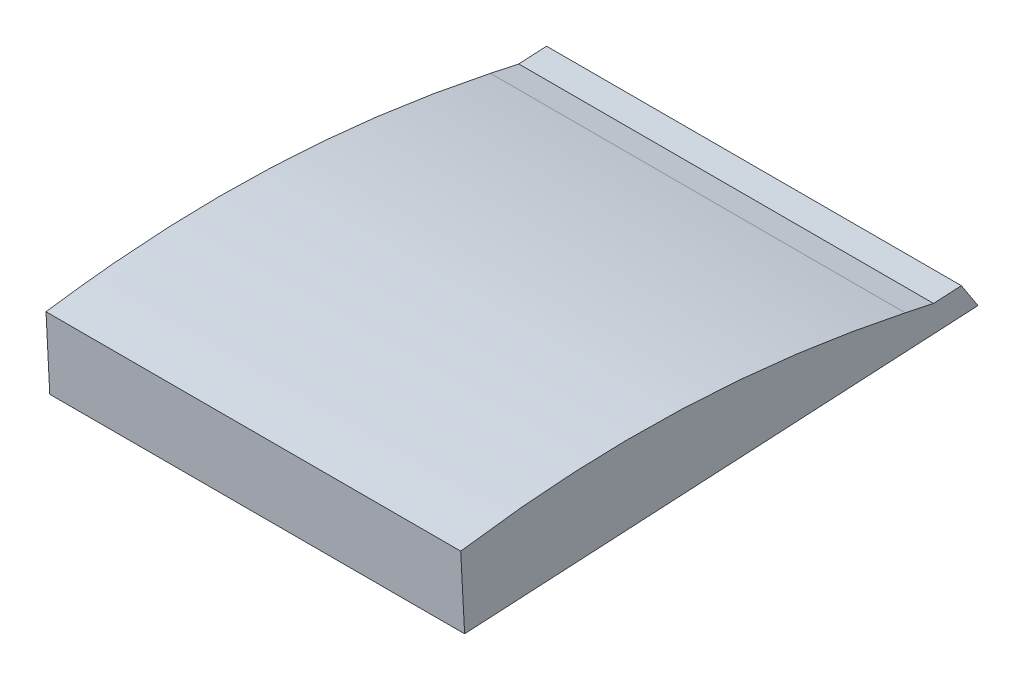
ISO-10303-21;
HEADER;
FILE_DESCRIPTION(('STEP AP214'),'2;1');
FILE_NAME('part.step','',(''),(''),'','','');
FILE_SCHEMA(('AUTOMOTIVE_DESIGN { 1 0 10303 214 1 1 1 1 }'));
ENDSEC;
DATA;
#1=APPLICATION_CONTEXT('core data for automotive mechanical design processes');
#2=APPLICATION_PROTOCOL_DEFINITION('international standard','automotive_design',2000,#1);
#3=PRODUCT_CONTEXT('',#1,'mechanical');
#4=PRODUCT('Part','Part','',(#3));
#5=PRODUCT_RELATED_PRODUCT_CATEGORY('part','',(#4));
#6=PRODUCT_DEFINITION_FORMATION('','',#4);
#7=PRODUCT_DEFINITION_CONTEXT('part definition',#1,'design');
#8=PRODUCT_DEFINITION('design','',#6,#7);
#9=PRODUCT_DEFINITION_SHAPE('','',#8);
#10=(LENGTH_UNIT() NAMED_UNIT(*) SI_UNIT(.MILLI.,.METRE.));
#11=(NAMED_UNIT(*) PLANE_ANGLE_UNIT() SI_UNIT($,.RADIAN.));
#12=(NAMED_UNIT(*) SI_UNIT($,.STERADIAN.) SOLID_ANGLE_UNIT());
#13=UNCERTAINTY_MEASURE_WITH_UNIT(LENGTH_MEASURE(1.E-05),#10,'distance_accuracy_value','');
#14=(GEOMETRIC_REPRESENTATION_CONTEXT(3) GLOBAL_UNCERTAINTY_ASSIGNED_CONTEXT((#13)) GLOBAL_UNIT_ASSIGNED_CONTEXT((#10,
#11,#12)) REPRESENTATION_CONTEXT('',''));
#15=CARTESIAN_POINT('',(0.,0.,0.));
#16=DIRECTION('',(0.,0.,1.));
#17=DIRECTION('',(1.,0.,0.));
#18=AXIS2_PLACEMENT_3D('',#15,#16,#17);
#19=CARTESIAN_POINT('',(-177.805940246243,-33.0381702413849,-314.355519034823));
#20=DIRECTION('',(-2.29475219526301E-07,0.0534934907984705,-0.998568198192863));
#21=DIRECTION('',(0.,0.99856819819289,0.053493490798472));
#22=AXIS2_PLACEMENT_3D('',#19,#20,#21);
#23=PLANE('',#22);
#24=CARTESIAN_POINT('',(-339.4243660882,-30.5401987010888,-314.221665077456));
#25=CARTESIAN_POINT('',(-312.486971740172,-30.5402152320651,-314.221672153351));
#26=CARTESIAN_POINT('',(-285.549577392142,-30.5402267068268,-314.221678958384));
#27=CARTESIAN_POINT('',(-231.674788696076,-30.540239543921,-314.221692026726));
#28=CARTESIAN_POINT('',(-204.737394348038,-30.5402409062534,-314.221698290034));
#29=CARTESIAN_POINT('',(-177.8,-30.5402372123712,-314.22170428248));
#30=B_SPLINE_CURVE_WITH_KNOTS('',3,(#24,#25,#26,#27,#28,#29),.UNSPECIFIED.,.F.,.F.,(4,2,4),(0.,
80.8121830440984,161.624366088212),.UNSPECIFIED.);
#31=CARTESIAN_POINT('',(-338.453246242115,-30.5401994156522,-314.221665338883));
#32=VERTEX_POINT('',#31);
#33=CARTESIAN_POINT('',(-177.8,-30.5402372123712,-314.22170428248));
#34=VERTEX_POINT('',#33);
#35=EDGE_CURVE('E107',#32,#34,#30,.T.);
#36=ORIENTED_EDGE('',*,*,#35,.T.);
#37=DIRECTION('',(0.,-0.99856819819289,-0.053493490798472));
#38=VECTOR('',#37,1.);
#39=CARTESIAN_POINT('',(-177.8,16.697356429359,-311.691177288541));
#40=LINE('',#39,#38);
#41=CARTESIAN_POINT('',(-177.8,-2.0412015642015,-312.695005454378));
#42=VERTEX_POINT('',#41);
#43=EDGE_CURVE('E110',#42,#34,#40,.T.);
#44=ORIENTED_EDGE('',*,*,#43,.F.);
#45=CARTESIAN_POINT('',(-177.8,-2.04120156395444,-312.695005454346));
#46=CARTESIAN_POINT('',(-231.674788696067,-2.041203180511,-312.694993159211));
#47=CARTESIAN_POINT('',(-285.549577392133,-2.04120479706756,-312.694980864076));
#48=CARTESIAN_POINT('',(-339.4243660882,-2.04120641362412,-312.694968568941));
#49=B_SPLINE_CURVE_WITH_KNOTS('',3,(#45,#46,#47,#48),.UNSPECIFIED.,.F.,.F.,(4,4),(0.,
161.624366088204),.UNSPECIFIED.);
#50=CARTESIAN_POINT('',(-338.385473794122,-2.04120638245378,-312.694968806027));
#51=VERTEX_POINT('',#50);
#52=EDGE_CURVE('E101',#42,#51,#49,.T.);
#53=ORIENTED_EDGE('',*,*,#52,.T.);
#54=DIRECTION('',(0.0023746530409731,0.998565382766486,0.0534933394298316));
#55=VECTOR('',#54,1.);
#56=CARTESIAN_POINT('',(-338.458280662959,-32.6572237938514,-314.335074741631));
#57=LINE('',#56,#55);
#58=EDGE_CURVE('E11',#32,#51,#57,.T.);
#59=ORIENTED_EDGE('',*,*,#58,.F.);
#60=EDGE_LOOP('',(#36,#44,#53,#59));
#61=FACE_BOUND('',#60,.T.);
#62=ADVANCED_FACE('F42',(#61),#23,.F.);
#63=CARTESIAN_POINT('',(-338.458326349272,-22.0071834208376,-513.140414741347));
#64=DIRECTION('',(-0.999997180507466,0.00237124073306189,0.000127257626607574));
#65=DIRECTION('',(-0.00237124075226242,-0.999997188604695,0.));
#66=AXIS2_PLACEMENT_3D('',#63,#64,#65);
#67=PLANE('',#66);
#68=CARTESIAN_POINT('',(-338.421966107711,-8.1921973731203,-484.839703055914));
#69=CARTESIAN_POINT('',(-338.421181065183,-7.9276801352114,-483.599649557664));
#70=CARTESIAN_POINT('',(-338.420407774643,-7.66817612943677,-482.358530301791));
#71=CARTESIAN_POINT('',(-338.418883804352,-7.1588090860353,-479.874324665595));
#72=CARTESIAN_POINT('',(-338.418133124422,-6.90894597217243,-478.631238300909));
#73=CARTESIAN_POINT('',(-338.416653468575,-6.41847064717817,-476.143241201893));
#74=CARTESIAN_POINT('',(-338.415924492693,-6.17785845103524,-474.898330464612));
#75=CARTESIAN_POINT('',(-338.414487373297,-5.70550989820997,-472.406823872788));
#76=CARTESIAN_POINT('',(-338.413779229836,-5.4737735643915,-471.160228013912));
#77=CARTESIAN_POINT('',(-338.412385940311,-5.01977728493128,-468.671173843882));
#78=CARTESIAN_POINT('',(-338.41170070426,-4.79747901518335,-467.428722518508));
#79=CARTESIAN_POINT('',(-338.41034945336,-4.36106545726815,-464.942384422169));
#80=CARTESIAN_POINT('',(-338.409683438495,-4.14695016213672,-463.698497652426));
#81=CARTESIAN_POINT('',(-338.408371302922,-3.72718615667847,-461.209292300444));
#82=CARTESIAN_POINT('',(-338.407725182267,-3.5215374684522,-459.963973714477));
#83=CARTESIAN_POINT('',(-338.406453325483,-3.11891182771031,-457.471935427268));
#84=CARTESIAN_POINT('',(-338.405827589353,-2.92193487406001,-456.225215726208));
#85=CARTESIAN_POINT('',(-338.4045993552,-2.53760176819606,-453.735114485534));
#86=CARTESIAN_POINT('',(-338.403996778324,-2.35021208381346,-452.491738126354));
#87=CARTESIAN_POINT('',(-338.402812941867,-1.98449397637572,-450.003655845422));
#88=CARTESIAN_POINT('',(-338.402231682286,-1.80616555321468,-448.758949923684));
#89=CARTESIAN_POINT('',(-338.400520292365,-1.28494182933728,-445.022921022155));
#90=CARTESIAN_POINT('',(-338.399422539028,-0.955804374409624,-442.529662968792));
#91=CARTESIAN_POINT('',(-338.397317971084,-0.335731146042398,-437.545921480532));
#92=CARTESIAN_POINT('',(-338.396310896304,-0.0446849161839743,-435.055451764851));
#93=CARTESIAN_POINT('',(-338.394385558934,0.499732384497002,-430.070387377483));
#94=CARTESIAN_POINT('',(-338.39346729651,0.753103384689815,-427.575792698071));
#95=CARTESIAN_POINT('',(-338.391722886641,1.22108098968549,-422.588135704244));
#96=CARTESIAN_POINT('',(-338.390896553907,1.43576612991089,-420.095080762749));
#97=CARTESIAN_POINT('',(-338.389335389288,1.82638585304561,-415.105935233159));
#98=CARTESIAN_POINT('',(-338.388600557353,2.00232045716166,-412.609844646727));
#99=CARTESIAN_POINT('',(-338.387224423397,2.31475677389295,-407.617858135544));
#100=CARTESIAN_POINT('',(-338.386583022793,2.45130020111536,-405.121964823881));
#101=CARTESIAN_POINT('',(-338.385394005156,2.6847373113862,-400.128325413424));
#102=CARTESIAN_POINT('',(-338.384846388004,2.78163104495287,-397.630579316995));
#103=CARTESIAN_POINT('',(-338.383845990461,2.93531325698474,-392.633022639554));
#104=CARTESIAN_POINT('',(-338.383393241566,2.99208843081899,-390.133211648658));
#105=CARTESIAN_POINT('',(-338.382584023607,3.06500304324894,-385.132980265987));
#106=CARTESIAN_POINT('',(-338.382227555056,3.081142265492,-382.632559871038));
#107=CARTESIAN_POINT('',(-338.381611856428,3.07230094663888,-377.629623665351));
#108=CARTESIAN_POINT('',(-338.381352710973,3.04728472210825,-375.127107918541));
#109=CARTESIAN_POINT('',(-338.380933335043,2.95558014722218,-370.122862691081));
#110=CARTESIAN_POINT('',(-338.380773103012,2.88889245245103,-367.621133198681));
#111=CARTESIAN_POINT('',(-338.380607809139,2.75714131201452,-363.86727505823));
#112=CARTESIAN_POINT('',(-338.38056521548,2.70787500503272,-362.614573609592));
#113=CARTESIAN_POINT('',(-338.380505258393,2.59872698329998,-360.109630198752));
#114=CARTESIAN_POINT('',(-338.380487894961,2.53884527015886,-358.857388236481));
#115=CARTESIAN_POINT('',(-338.380478066317,2.4086085872441,-356.353403583727));
#116=CARTESIAN_POINT('',(-338.380485602038,2.33825322497624,-355.101660913718));
#117=CARTESIAN_POINT('',(-338.380525299071,2.18719084924111,-352.598798445413));
#118=CARTESIAN_POINT('',(-338.380557460401,2.10648382815962,-351.347678647576));
#119=CARTESIAN_POINT('',(-338.380631430017,1.96327734740154,-349.260513894903));
#120=CARTESIAN_POINT('',(-338.380666512497,1.90360381755742,-348.424273848118));
#121=CARTESIAN_POINT('',(-338.380747483531,1.77971767487551,-346.752129963033));
#122=CARTESIAN_POINT('',(-338.380793372081,1.71550506371535,-345.91622612461));
#123=CARTESIAN_POINT('',(-338.380895833481,1.5825932669786,-344.244776161936));
#124=CARTESIAN_POINT('',(-338.38095240632,1.5138940859755,-343.409230037322));
#125=CARTESIAN_POINT('',(-338.381076511464,1.37189838510836,-341.738593853702));
#126=CARTESIAN_POINT('',(-338.381144042914,1.29860222435389,-340.9035037642));
#127=CARTESIAN_POINT('',(-338.381290436261,1.14725472802511,-339.233753828497));
#128=CARTESIAN_POINT('',(-338.381369298165,1.06920338969506,-338.399093982547));
#129=CARTESIAN_POINT('',(-338.381538696809,0.9082023305549,-336.730242306721));
#130=CARTESIAN_POINT('',(-338.381629233608,0.825252584793145,-335.896050479251));
#131=CARTESIAN_POINT('',(-338.381822733186,0.653951589037201,-334.22466250792));
#132=CARTESIAN_POINT('',(-338.381925746809,0.565579014314354,-333.387468547978));
#133=CARTESIAN_POINT('',(-338.382144253551,0.383601705846196,-331.713652322694));
#134=CARTESIAN_POINT('',(-338.382259746627,0.289996990027161,-330.877030055404));
#135=CARTESIAN_POINT('',(-338.382503509565,0.0974330337181293,-329.204413237958));
#136=CARTESIAN_POINT('',(-338.382631779239,-0.00152612815640652,-328.368418678768));
#137=CARTESIAN_POINT('',(-338.382834159871,-0.15414692675181,-327.114893861878));
#138=CARTESIAN_POINT('',(-338.382903286616,-0.205720321518228,-326.697108416598));
#139=CARTESIAN_POINT('',(-338.38304455333,-0.310129384296508,-325.861695169495));
#140=CARTESIAN_POINT('',(-338.3831166933,-0.362965052859836,-325.444067367741));
#141=CARTESIAN_POINT('',(-338.383336725389,-0.522985359156332,-324.191370740989));
#142=CARTESIAN_POINT('',(-338.383488228579,-0.631682467389962,-323.356495452376));
#143=CARTESIAN_POINT('',(-338.383796451968,-0.851261666058094,-321.687026785455));
#144=CARTESIAN_POINT('',(-338.383953172214,-0.962143776247043,-320.852433409766));
#145=CARTESIAN_POINT('',(-338.384189159753,-1.12892866158154,-319.599068533883));
#146=CARTESIAN_POINT('',(-338.384268116331,-1.18470133318535,-319.180279679156));
#147=CARTESIAN_POINT('',(-338.384425614636,-1.29607296418954,-318.342678898292));
#148=CARTESIAN_POINT('',(-338.384504156363,-1.35167192361084,-317.923866972156));
#149=CARTESIAN_POINT('',(-338.384660702772,-1.46264478904278,-317.086216499264));
#150=CARTESIAN_POINT('',(-338.384738707458,-1.51801869673389,-316.66737795273));
#151=CARTESIAN_POINT('',(-338.38489435925,-1.62861677631125,-315.829681061893));
#152=CARTESIAN_POINT('',(-338.384972006356,-1.68384094818454,-315.410822717589));
#153=CARTESIAN_POINT('',(-338.385204579441,-1.84935910309539,-314.154230354546));
#154=CARTESIAN_POINT('',(-338.385359137734,-1.95949911403767,-313.316476066499));
#155=CARTESIAN_POINT('',(-338.385668212375,-2.179752586274,-311.641132580794));
#156=CARTESIAN_POINT('',(-338.385822728724,-2.28986604851011,-310.803543383259));
#157=CARTESIAN_POINT('',(-338.386132836209,-2.51054320965579,-309.12842128005));
#158=CARTESIAN_POINT('',(-338.386288427348,-2.62110691014257,-308.290888374582));
#159=CARTESIAN_POINT('',(-338.386600670542,-2.84267889968388,-306.615875103984));
#160=CARTESIAN_POINT('',(-338.386757322605,-2.95368719200352,-305.778394739286));
#161=CARTESIAN_POINT('',(-338.386914497317,-3.06491433448685,-304.940943462951));
#162=B_SPLINE_CURVE_WITH_KNOTS('',3,(#68,#69,#70,#71,#72,#73,#74,#75,#76,#77,#78,#79,#80,#81,
#82,#83,#84,#85,#86,#87,#88,#89,#90,#91,#92,#93,#94,#95,#96,#97,#98,#99,#100,#101,#102,#103,
#104,#105,#106,#107,#108,#109,#110,#111,#112,#113,#114,#115,#116,#117,#118,#119,#120,#121,#122,
#123,#124,#125,#126,#127,#128,#129,#130,#131,#132,#133,#134,#135,#136,#137,#138,#139,#140,#141,
#142,#143,#144,#145,#146,#147,#148,#149,#150,#151,#152,#153,#154,#155,#156,#157,#158,#159,#160,
#161),.UNSPECIFIED.,.F.,.F.,(4,2,2,2,2,2,2,2,2,2,2,2,2,2,2,2,2,2,2,2,2,2,2,2,2,2,2,2,2,2,2,2,2,
2,2,2,2,2,2,2,2,2,2,2,2,2,4),(0.,3.80384090473611,7.60765172416373,11.4114687063184,
15.2152954862947,19.001812757504,22.7883268061113,26.5748507381017,30.3613741746301,
34.1335938534063,37.9058134880981,45.4501801000073,52.9721606080707,60.4941552174103,
68.0007031780823,75.5072470306889,83.0058121489985,90.5043677132498,98.0054088789903,
105.506489981449,113.014078252456,120.521548415486,124.28252084476,128.043492703687,
131.804605538456,135.56572113975,138.080809289137,140.595896508962,143.110981165019,
145.625869590351,148.140759473141,150.655662167455,153.18118180762,155.706692795422,
158.232166713029,159.495034798765,160.757903436238,163.283661136925,165.809441683295,
167.076900694069,168.344359552236,169.611808928887,170.879258415342,173.41414849398,
175.948537134471,178.482934660627,181.017350833808),.UNSPECIFIED.);
#163=CARTESIAN_POINT('',(-338.421966107711,-8.1921973731203,-484.839703055914));
#164=VERTEX_POINT('',#163);
#165=EDGE_CURVE('E105',#164,#51,#162,.T.);
#166=ORIENTED_EDGE('',*,*,#165,.F.);
#167=DIRECTION('',(0.000619140515082298,0.208617015467726,0.977997217543262));
#168=VECTOR('',#167,1.);
#169=CARTESIAN_POINT('',(-338.421904535693,-8.17145091853281,-484.742443612263));
#170=LINE('',#169,#168);
#171=CARTESIAN_POINT('',(-338.428910877982,-10.5322169560735,-495.811485536326));
#172=VERTEX_POINT('',#171);
#173=EDGE_CURVE('E163',#172,#164,#170,.T.);
#174=ORIENTED_EDGE('',*,*,#173,.F.);
#175=CARTESIAN_POINT('',(-338.428910514005,-9.95417148300831,-506.57767153548));
#176=CARTESIAN_POINT('',(-338.428910539208,-10.0069259570138,-505.594873412896));
#177=CARTESIAN_POINT('',(-338.428910564299,-10.0596804275362,-504.612075290126));
#178=CARTESIAN_POINT('',(-338.428910614351,-10.1651893616146,-502.64647904421));
#179=CARTESIAN_POINT('',(-338.428910639312,-10.2179438251707,-501.663680921065));
#180=CARTESIAN_POINT('',(-338.428910706009,-10.3590122650935,-499.035622595269));
#181=CARTESIAN_POINT('',(-338.428910747711,-10.4473262351817,-497.390362392281));
#182=CARTESIAN_POINT('',(-338.428910789578,-10.535640195508,-495.745102188769));
#183=B_SPLINE_CURVE_WITH_KNOTS('',3,(#175,#176,#177,#178,#179,#180,#181,#182),.UNSPECIFIED.,.F.,
.F.,(4,2,2,4),(0.,2.95263893128455,5.90527786256939,10.8481641080384),.UNSPECIFIED.);
#184=CARTESIAN_POINT('',(-338.428909818147,-9.9539337396788,-506.578014973101));
#185=VERTEX_POINT('',#184);
#186=EDGE_CURVE('E255',#185,#172,#183,.T.);
#187=ORIENTED_EDGE('',*,*,#186,.F.);
#188=CARTESIAN_POINT('',(-338.453200630106,-19.8517672805841,-513.024948684549));
#189=CARTESIAN_POINT('',(-338.445049954709,-16.530565679203,-510.861746521049));
#190=CARTESIAN_POINT('',(-338.436899279311,-13.2093640778218,-508.698544357549));
#191=CARTESIAN_POINT('',(-338.428748603914,-9.8881624764407,-506.535342194049));
#192=B_SPLINE_CURVE_WITH_KNOTS('',3,(#188,#189,#190,#191),.UNSPECIFIED.,.F.,.F.,(4,4),(0.,
11.8907111223964),.UNSPECIFIED.);
#193=CARTESIAN_POINT('',(-338.453200630106,-19.8517672805846,-513.024948684549));
#194=VERTEX_POINT('',#193);
#195=EDGE_CURVE('E175',#194,#185,#192,.T.);
#196=ORIENTED_EDGE('',*,*,#195,.F.);
#197=CARTESIAN_POINT('',(-338.453248371395,-31.0391668536749,-304.940943462951));
#198=CARTESIAN_POINT('',(-338.453232457708,-27.3100336626448,-374.302278536817));
#199=CARTESIAN_POINT('',(-338.453216544022,-23.5809004716147,-443.663613610683));
#200=CARTESIAN_POINT('',(-338.453200630335,-19.8517672805846,-513.024948684549));
#201=B_SPLINE_CURVE_WITH_KNOTS('',3,(#197,#198,#199,#200),.UNSPECIFIED.,.F.,.F.,(4,4),(0.,
208.384527108594),.UNSPECIFIED.);
#202=EDGE_CURVE('E113',#32,#194,#201,.T.);
#203=ORIENTED_EDGE('',*,*,#202,.F.);
#204=ORIENTED_EDGE('',*,*,#58,.T.);
#205=EDGE_LOOP('',(#166,#174,#187,#196,#203,#204));
#206=FACE_BOUND('',#205,.T.);
#207=ADVANCED_FACE('F142',(#206),#67,.T.);
#208=CARTESIAN_POINT('',(-177.8,-6.51913907058263,69.5663617744474));
#209=CARTESIAN_POINT('',(-177.8,-6.88721273253516,69.4883910827677));
#210=CARTESIAN_POINT('',(-177.8,-7.61052758633523,69.3363760132391));
#211=CARTESIAN_POINT('',(-177.8,-8.76184326811464,69.0354225894495));
#212=CARTESIAN_POINT('',(-177.8,-9.88259406782119,68.626070203946));
#213=CARTESIAN_POINT('',(-177.8,-12.021228930256,67.6619851025588));
#214=CARTESIAN_POINT('',(-177.8,-14.9546020256939,65.6923130131807));
#215=CARTESIAN_POINT('',(-177.8,-18.1374494761777,62.3412188200519));
#216=CARTESIAN_POINT('',(-177.8,-21.5964876349103,57.3382189268778));
#217=CARTESIAN_POINT('',(-177.8,-24.7903629698325,50.5220499235312));
#218=CARTESIAN_POINT('',(-177.8,-27.5359775514862,42.0059138994073));
#219=CARTESIAN_POINT('',(-177.8,-29.5513425657538,33.3240400078997));
#220=CARTESIAN_POINT('',(-177.8,-31.532992144648,21.6352015564033));
#221=CARTESIAN_POINT('',(-177.8,-33.0186008410447,6.91344102508237));
#222=CARTESIAN_POINT('',(-177.8,-33.7765423596692,-10.7972873340441));
#223=CARTESIAN_POINT('',(-177.8,-33.7950491418743,-28.5097311954228));
#224=CARTESIAN_POINT('',(-177.8,-33.2586088383385,-46.2043865238911));
#225=CARTESIAN_POINT('',(-177.8,-31.9669194489648,-69.7641945581866));
#226=CARTESIAN_POINT('',(-177.8,-29.5034076215053,-99.1460197389462));
#227=CARTESIAN_POINT('',(-177.8,-25.6933715620582,-134.308212307564));
#228=CARTESIAN_POINT('',(-177.8,-21.3490549530988,-169.399514794737));
#229=CARTESIAN_POINT('',(-177.8,-16.7038848255612,-204.446464420127));
#230=CARTESIAN_POINT('',(-177.8,-11.9288122826792,-239.471434511741));
#231=CARTESIAN_POINT('',(-177.8,-7.93942067939684,-268.654643904962));
#232=CARTESIAN_POINT('',(-177.8,-4.79172290140647,-292.007732636027));
#233=CARTESIAN_POINT('',(-177.8,-2.83780100098235,-306.600292672818));
#234=CARTESIAN_POINT('',(-177.8,-1.30907436693598,-318.288997719976));
#235=CARTESIAN_POINT('',(-177.8,0.263068831943658,-329.949567815073));
#236=CARTESIAN_POINT('',(-177.8,1.719295513011,-344.570295270056));
#237=CARTESIAN_POINT('',(-177.8,2.80506666571039,-362.175990442094));
#238=CARTESIAN_POINT('',(-177.8,3.31793184017618,-385.687405296962));
#239=CARTESIAN_POINT('',(-177.8,2.25388387982141,-415.082460117617));
#240=CARTESIAN_POINT('',(-177.8,-0.960221939673565,-444.321872591633));
#241=CARTESIAN_POINT('',(-177.8,-4.72777257870521,-467.542126740326));
#242=CARTESIAN_POINT('',(-177.8,-6.96557190432381,-479.089279042028));
#243=CARTESIAN_POINT('',(-177.8,-8.1921973731203,-484.839703055914));
#244=B_SPLINE_CURVE_WITH_KNOTS('',3,(#208,#209,#210,#211,#212,#213,#214,#215,#216,#217,#218,
#219,#220,#221,#222,#223,#224,#225,#226,#227,#228,#229,#230,#231,#232,#233,#234,#235,#236,#237,
#238,#239,#240,#241,#242,#243),.UNSPECIFIED.,.F.,.F.,(4,1,1,1,1,1,1,1,1,1,1,1,1,1,1,1,1,1,1,1,1,
1,1,1,1,1,1,1,1,1,1,1,1,4),(-6.87555594952044E-05,0.00188450372870693,0.00383776301690907,
0.00579102230511121,0.00774428159331335,0.0155573187461219,0.0233703558989304,0.031183393051739,
0.0468094673573561,0.0624355416629732,0.0780616159685904,0.0936876902742075,0.124939838885442,
0.156191987496676,0.18744413610791,0.218696284719144,0.249948433330378,0.312452730552847,
0.374957027775315,0.437461324997784,0.499965622220252,0.562469919442721,0.624974216665189,
0.656226365276424,0.687478513887658,0.703104588193275,0.718730662498892,0.749982811110126,
0.78123495972136,0.812487108332595,0.874991405555063,0.937495702777532,0.968747851388766,1.),.UNSPECIFIED.);
#245=DIRECTION('',(-1.,0.,0.));
#246=VECTOR('',#245,1.);
#247=SURFACE_OF_LINEAR_EXTRUSION('',#244,#246);
#248=ORIENTED_EDGE('',*,*,#52,.F.);
#249=CARTESIAN_POINT('',(-177.8,-8.1921973731203,-484.839703055914));
#250=VERTEX_POINT('',#249);
#251=EDGE_CURVE('E71',#42,#250,#244,.T.);
#252=ORIENTED_EDGE('',*,*,#251,.T.);
#253=DIRECTION('',(-1.,0.,0.));
#254=VECTOR('',#253,1.);
#255=CARTESIAN_POINT('',(-177.8,-8.1921973731203,-484.839703055914));
#256=LINE('',#255,#254);
#257=EDGE_CURVE('E126',#250,#164,#256,.T.);
#258=ORIENTED_EDGE('',*,*,#257,.T.);
#259=ORIENTED_EDGE('',*,*,#165,.T.);
#260=EDGE_LOOP('',(#248,#252,#258,#259));
#261=FACE_BOUND('',#260,.T.);
#262=ADVANCED_FACE('F103',(#261),#247,.T.);
#263=CARTESIAN_POINT('',(-177.8,0.,0.));
#264=DIRECTION('',(-1.,0.,0.));
#265=DIRECTION('',(0.,0.,1.));
#266=AXIS2_PLACEMENT_3D('',#263,#264,#265);
#267=PLANE('',#266);
#268=ORIENTED_EDGE('',*,*,#251,.F.);
#269=ORIENTED_EDGE('',*,*,#43,.T.);
#270=DIRECTION('',(0.,-0.0536864833252265,0.998557840842567));
#271=VECTOR('',#270,1.);
#272=CARTESIAN_POINT('',(-177.8,-19.8517756392125,-513.024949519574));
#273=LINE('',#272,#271);
#274=CARTESIAN_POINT('',(-177.8,-19.8517756392125,-513.024949519574));
#275=VERTEX_POINT('',#274);
#276=EDGE_CURVE('E124',#275,#34,#273,.T.);
#277=ORIENTED_EDGE('',*,*,#276,.F.);
#278=DIRECTION('',(0.,-0.837933215655186,-0.545772778820783));
#279=VECTOR('',#278,1.);
#280=CARTESIAN_POINT('',(-177.8,92.2081632145719,-440.03671718784));
#281=LINE('',#280,#279);
#282=CARTESIAN_POINT('',(-177.8,-9.95392768556176,-506.578163688574));
#283=VERTEX_POINT('',#282);
#284=EDGE_CURVE('E62',#283,#275,#281,.T.);
#285=ORIENTED_EDGE('',*,*,#284,.F.);
#286=DIRECTION('',(0.,0.0536864833252206,-0.998557840842568));
#287=VECTOR('',#286,1.);
#288=CARTESIAN_POINT('',(-177.8,-10.2433380586428,-501.195188694467));
#289=LINE('',#288,#287);
#290=CARTESIAN_POINT('',(-177.8,-10.5327484317238,-495.81221370036));
#291=VERTEX_POINT('',#290);
#292=EDGE_CURVE('E54',#291,#283,#289,.T.);
#293=ORIENTED_EDGE('',*,*,#292,.F.);
#294=DIRECTION('',(0.,-0.208617055452837,-0.977997404993586));
#295=VECTOR('',#294,1.);
#296=CARTESIAN_POINT('',(-177.8,-8.1921973731203,-484.839703055914));
#297=LINE('',#296,#295);
#298=EDGE_CURVE('E117',#250,#291,#297,.T.);
#299=ORIENTED_EDGE('',*,*,#298,.F.);
#300=EDGE_LOOP('',(#268,#269,#277,#285,#293,#299));
#301=FACE_BOUND('',#300,.T.);
#302=ADVANCED_FACE('F115',(#301),#267,.F.);
#303=CARTESIAN_POINT('',(-177.8,-10.5327484317238,-495.81221370036));
#304=CARTESIAN_POINT('',(-274.207207620428,-10.532748431724,-495.81221370036));
#305=CARTESIAN_POINT('',(-376.016408166547,-10.532743263631,-495.812208410507));
#306=CARTESIAN_POINT('',(-478.598502144422,-10.52834825828,-495.807709851592));
#307=CARTESIAN_POINT('',(-484.78976742605,-10.5346710511193,-495.814181619831));
#308=CARTESIAN_POINT('',(-485.586919347094,-10.5438544894442,-495.823581435074));
#309=CARTESIAN_POINT('',(-485.898481465598,-10.5318587580024,-495.811303064461));
#310=CARTESIAN_POINT('',(-486.364982708455,-10.4951657543597,-495.773745513276));
#311=CARTESIAN_POINT('',(-490.154991884245,-10.2587392399741,-495.531748401184));
#312=CARTESIAN_POINT('',(-493.937468198988,-10.0216632597841,-495.289086520806));
#313=CARTESIAN_POINT('',(-497.394940800443,-9.80517690591262,-495.06749939222));
#314=CARTESIAN_POINT('',(-177.8,-10.3398081830031,-499.400863696431));
#315=CARTESIAN_POINT('',(-274.209418385163,-10.3398081830033,-499.400863696431));
#316=CARTESIAN_POINT('',(-376.020964999451,-10.3398096449536,-499.400850263422));
#317=CARTESIAN_POINT('',(-478.598950286788,-10.3373942044883,-499.396812477319));
#318=CARTESIAN_POINT('',(-484.789762654161,-10.3409407130188,-499.402476865087));
#319=CARTESIAN_POINT('',(-485.586696813438,-10.3474601962453,-499.407941600412));
#320=CARTESIAN_POINT('',(-485.898471801464,-10.3387856060166,-499.40112355767));
#321=CARTESIAN_POINT('',(-486.365645745773,-10.312296407861,-499.380177483482));
#322=CARTESIAN_POINT('',(-490.159006538096,-10.1388025714563,-499.250895227081));
#323=CARTESIAN_POINT('',(-493.938944912067,-9.96427417884317,-499.122384197364));
#324=CARTESIAN_POINT('',(-497.394170964434,-9.8052415520001,-499.0043512248));
#325=CARTESIAN_POINT('',(-177.8,-10.1468679342825,-502.989513692503));
#326=CARTESIAN_POINT('',(-274.211629149898,-10.1468679342826,-502.989513692501));
#327=CARTESIAN_POINT('',(-376.025521832354,-10.1468760262763,-502.989492116337));
#328=CARTESIAN_POINT('',(-478.599398429154,-10.1464401506966,-502.985915103046));
#329=CARTESIAN_POINT('',(-484.789757882272,-10.1472103749182,-502.990772110343));
#330=CARTESIAN_POINT('',(-485.586474279782,-10.1510659030465,-502.99230176575));
#331=CARTESIAN_POINT('',(-485.898462137329,-10.1457124540309,-502.990944050878));
#332=CARTESIAN_POINT('',(-486.366308783091,-10.1294270613623,-502.986609453688));
#333=CARTESIAN_POINT('',(-490.163021191948,-10.0188659029384,-502.970042052979));
#334=CARTESIAN_POINT('',(-493.940421625146,-9.9068850979022,-502.955681873922));
#335=CARTESIAN_POINT('',(-497.393401128424,-9.80530619808759,-502.94120305738));
#336=CARTESIAN_POINT('',(-177.8,-9.9539276855618,-506.578163688574));
#337=CARTESIAN_POINT('',(-274.213839914632,-9.95392768556193,-506.578163688573));
#338=CARTESIAN_POINT('',(-376.030078665256,-9.95394240759896,-506.578133969256));
#339=CARTESIAN_POINT('',(-478.59984657152,-9.95548609690482,-506.575017728773));
#340=CARTESIAN_POINT('',(-484.789753110383,-9.95348003681767,-506.579067355599));
#341=CARTESIAN_POINT('',(-485.586251746126,-9.95467160984757,-506.576661931089));
#342=CARTESIAN_POINT('',(-485.898452473195,-9.95263930204514,-506.580764544087));
#343=CARTESIAN_POINT('',(-486.366971820409,-9.94655771486366,-506.593041423894));
#344=CARTESIAN_POINT('',(-490.1670358458,-9.89892923442059,-506.689188878877));
#345=CARTESIAN_POINT('',(-493.941898338224,-9.84949601696124,-506.78897955048));
#346=CARTESIAN_POINT('',(-497.392631292415,-9.80537084417507,-506.878054889959));
#347=B_SPLINE_SURFACE_WITH_KNOTS('',3,3,((#303,#304,#305,#306,#307,#308,#309,#310,#311,#312,
#313),(#314,#315,#316,#317,#318,#319,#320,#321,#322,#323,#324),(#325,#326,#327,#328,#329,#330,
#331,#332,#333,#334,#335),(#336,#337,#338,#339,#340,#341,#342,#343,#344,#345,#346)),
.UNSPECIFIED.,.F.,.F.,.F.,(4,4),(4,1,1,1,1,1,1,1,4),(0.,1.),(0.,0.90625,0.95703125,0.962890625,
0.96435546875,0.96450845898134,0.9658203125,0.96875,1.),.UNSPECIFIED.);
#348=CARTESIAN_POINT('',(-177.8,-9.9539276855618,-506.578163688574));
#349=CARTESIAN_POINT('',(-274.213839914632,-9.95392768556193,-506.578163688573));
#350=CARTESIAN_POINT('',(-376.030078665256,-9.95394240759896,-506.578133969256));
#351=CARTESIAN_POINT('',(-478.59984657152,-9.95548609690482,-506.575017728773));
#352=CARTESIAN_POINT('',(-484.789753110383,-9.95348003681767,-506.579067355599));
#353=CARTESIAN_POINT('',(-485.586251746126,-9.95467160984757,-506.576661931089));
#354=CARTESIAN_POINT('',(-485.898452473195,-9.95263930204514,-506.580764544087));
#355=CARTESIAN_POINT('',(-486.366971820409,-9.94655771486366,-506.593041423894));
#356=CARTESIAN_POINT('',(-490.1670358458,-9.89892923442059,-506.689188878877));
#357=CARTESIAN_POINT('',(-493.941898338224,-9.84949601696124,-506.78897955048));
#358=CARTESIAN_POINT('',(-497.392631292415,-9.80537084417507,-506.878054889959));
#359=B_SPLINE_CURVE_WITH_KNOTS('',3,(#348,#349,#350,#351,#352,#353,#354,#355,#356,#357,#358),
.UNSPECIFIED.,.F.,.F.,(4,1,1,1,1,1,1,1,4),(0.,0.90625,0.95703125,0.962890625,0.96435546875,
0.96450845898134,0.9658203125,0.96875,1.),.UNSPECIFIED.);
#360=EDGE_CURVE('E211',#283,#185,#359,.T.);
#361=CARTESIAN_POINT('',(-177.8,-10.5327484317237,-495.81221370036));
#362=CARTESIAN_POINT('',(-195.905547489319,-10.5327480908977,-495.812213148644));
#363=CARTESIAN_POINT('',(-214.011094979851,-10.5327482614981,-495.812213424805));
#364=CARTESIAN_POINT('',(-250.222189957317,-10.5326761844897,-495.812096749368));
#365=CARTESIAN_POINT('',(-268.32773744425,-10.5326039368808,-495.811979797769));
#366=CARTESIAN_POINT('',(-294.742475137036,-10.5323921333525,-495.811636938513));
#367=CARTESIAN_POINT('',(-303.051665344397,-10.5323101468247,-495.811504221932));
#368=CARTESIAN_POINT('',(-319.670045756176,-10.5321084638325,-495.811177745404));
#369=CARTESIAN_POINT('',(-327.979235960594,-10.5319887673683,-495.810983985456));
#370=CARTESIAN_POINT('',(-344.597616359219,-10.5317050758423,-495.810524756726));
#371=CARTESIAN_POINT('',(-352.906806553425,-10.5315410807807,-495.810259287943));
#372=CARTESIAN_POINT('',(-369.525186944559,-10.5311627710675,-495.809646894997));
#373=CARTESIAN_POINT('',(-377.834377141487,-10.5309484564158,-495.809299970833));
#374=CARTESIAN_POINT('',(-390.298162467894,-10.5305852931125,-495.808712096302));
#375=CARTESIAN_POINT('',(-394.452757599598,-10.5304572901231,-495.808504890077));
#376=CARTESIAN_POINT('',(-402.76194785593,-10.5301868057522,-495.808067040571));
#377=CARTESIAN_POINT('',(-406.916542980558,-10.5300443243706,-495.807836397291));
#378=CARTESIAN_POINT('',(-415.225733202429,-10.5297443309649,-495.807350779716));
#379=CARTESIAN_POINT('',(-419.380328299671,-10.5295868189407,-495.807095805421));
#380=CARTESIAN_POINT('',(-427.689518513364,-10.5292562529775,-495.806560698187));
#381=CARTESIAN_POINT('',(-431.844113629814,-10.5290831990383,-495.806280565249));
#382=CARTESIAN_POINT('',(-438.076006370027,-10.5288115951607,-495.80584090353));
#383=CARTESIAN_POINT('',(-440.153303994745,-10.528719056705,-495.805691105902));
#384=CARTESIAN_POINT('',(-444.307899232754,-10.5285299143757,-495.805384929708));
#385=CARTESIAN_POINT('',(-446.385196846045,-10.5284333105019,-495.805228551141));
#386=CARTESIAN_POINT('',(-450.539792014286,-10.5282359793606,-495.804909119219));
#387=CARTESIAN_POINT('',(-452.617089569236,-10.5281352520932,-495.804746065863));
#388=CARTESIAN_POINT('',(-456.771684718942,-10.5279296127677,-495.804413184978));
#389=CARTESIAN_POINT('',(-458.848982313699,-10.5278247007096,-495.804243357447));
#390=CARTESIAN_POINT('',(-461.964928795581,-10.5276641623777,-495.803983484283));
#391=CARTESIAN_POINT('',(-463.003577683034,-10.5276101212238,-495.80389600458));
#392=CARTESIAN_POINT('',(-465.080875482529,-10.5275009534944,-495.803719288136));
#393=CARTESIAN_POINT('',(-466.119524394573,-10.5274458269189,-495.803630051395));
#394=CARTESIAN_POINT('',(-468.196822178401,-10.5273345706894,-495.803449954168));
#395=CARTESIAN_POINT('',(-469.235471050185,-10.5272784410353,-495.803359093682));
#396=CARTESIAN_POINT('',(-471.312768738857,-10.5272651192038,-495.803337528823));
#397=CARTESIAN_POINT('',(-472.351417555745,-10.5273079270194,-495.803406824438));
#398=CARTESIAN_POINT('',(-473.909390713477,-10.5275208406789,-495.803751480731));
#399=CARTESIAN_POINT('',(-474.428715088771,-10.5276165955549,-495.803906484974));
#400=CARTESIAN_POINT('',(-475.467363801297,-10.5278700443396,-495.804316757939));
#401=CARTESIAN_POINT('',(-475.98668813853,-10.52802773825,-495.804572026665));
#402=CARTESIAN_POINT('',(-477.025336767934,-10.5284174077029,-495.805202808313));
#403=CARTESIAN_POINT('',(-477.544661060106,-10.5286493832532,-495.805578321248));
#404=CARTESIAN_POINT('',(-478.583309463486,-10.5291999338322,-495.806469530961));
#405=CARTESIAN_POINT('',(-479.102633574695,-10.5295185088577,-495.806985227734));
#406=CARTESIAN_POINT('',(-479.881619750705,-10.5300705089879,-495.807878783924));
#407=CARTESIAN_POINT('',(-480.141281911642,-10.5302668653872,-495.808196637973));
#408=CARTESIAN_POINT('',(-480.660606152935,-10.5306858548653,-495.808874881729));
#409=CARTESIAN_POINT('',(-480.92026823329,-10.5309084879437,-495.809235271436));
#410=CARTESIAN_POINT('',(-481.439592206418,-10.5313814252238,-495.810000843781));
#411=CARTESIAN_POINT('',(-481.69925409919,-10.5316317294152,-495.810406026402));
#412=CARTESIAN_POINT('',(-482.088746933262,-10.5320294641792,-495.81104986386));
#413=CARTESIAN_POINT('',(-482.218577915986,-10.5321657555574,-495.811270487004));
#414=CARTESIAN_POINT('',(-482.478239785705,-10.5324453093713,-495.811723017769));
#415=CARTESIAN_POINT('',(-482.608070672701,-10.5325885718032,-495.811954925382));
#416=CARTESIAN_POINT('',(-482.86773330564,-10.5328848884765,-495.812434591207));
#417=CARTESIAN_POINT('',(-482.997565051584,-10.5330379427855,-495.812682349528));
#418=CARTESIAN_POINT('',(-483.257228777476,-10.5333441619193,-495.813178045067));
#419=CARTESIAN_POINT('',(-483.387060757423,-10.5334973267443,-495.813425982287));
#420=CARTESIAN_POINT('',(-483.646723954543,-10.5338460484696,-495.813990479357));
#421=CARTESIAN_POINT('',(-483.776555171716,-10.5340416051759,-495.814307038894));
#422=CARTESIAN_POINT('',(-484.036216538545,-10.5346248570498,-495.815251184182));
#423=CARTESIAN_POINT('',(-484.1660466882,-10.535012552477,-495.815878770355));
#424=CARTESIAN_POINT('',(-484.382443857066,-10.5359287390021,-495.817361857216));
#425=CARTESIAN_POINT('',(-484.469012218105,-10.5363672750979,-495.818071742272));
#426=CARTESIAN_POINT('',(-484.642142602601,-10.5374295859347,-495.819791369446));
#427=CARTESIAN_POINT('',(-484.728704626166,-10.538053355584,-495.820801103322));
#428=CARTESIAN_POINT('',(-484.858539510956,-10.5391581284588,-495.82258946638));
#429=CARTESIAN_POINT('',(-484.901814998987,-10.5395545563836,-495.823231188378));
#430=CARTESIAN_POINT('',(-484.988360873459,-10.540409393487,-495.824614965198));
#431=CARTESIAN_POINT('',(-485.031631260048,-10.5408677985169,-495.825357013306));
#432=CARTESIAN_POINT('',(-485.118197535197,-10.5418500899584,-495.826947108217));
#433=CARTESIAN_POINT('',(-485.161493422022,-10.5423740187984,-495.827795223702));
#434=CARTESIAN_POINT('',(-485.226439449906,-10.5432183943723,-495.829162065809));
#435=CARTESIAN_POINT('',(-485.248090957425,-10.5435096364398,-495.82963351706));
#436=CARTESIAN_POINT('',(-485.291393516648,-10.5441020831769,-495.830592546633));
#437=CARTESIAN_POINT('',(-485.31304456835,-10.5444032878979,-495.831080125038));
#438=CARTESIAN_POINT('',(-485.377996960315,-10.5452282921528,-495.832415609612));
#439=CARTESIAN_POINT('',(-485.421302563909,-10.5456735699569,-495.833136407881));
#440=CARTESIAN_POINT('',(-485.507903368224,-10.5459043073641,-495.833509916558));
#441=CARTESIAN_POINT('',(-485.551198557698,-10.5456901915008,-495.833163314185));
#442=CARTESIAN_POINT('',(-485.616135752117,-10.5445511333874,-495.831319451526));
#443=CARTESIAN_POINT('',(-485.637802983713,-10.5440341728365,-495.830482616034));
#444=CARTESIAN_POINT('',(-485.681101649318,-10.5426759651842,-495.828284002685));
#445=CARTESIAN_POINT('',(-485.70273308385,-10.5418347228716,-495.826922232579));
#446=CARTESIAN_POINT('',(-485.745982945439,-10.5397851114668,-495.823604401916));
#447=CARTESIAN_POINT('',(-485.767601224016,-10.5385758891881,-495.821646960254));
#448=CARTESIAN_POINT('',(-485.810774364935,-10.5358639883511,-495.817257041399));
#449=CARTESIAN_POINT('',(-485.832329219064,-10.5343612733458,-495.814824505206));
#450=CARTESIAN_POINT('',(-485.85384985177,-10.5327484684957,-495.812213759885));
#451=B_SPLINE_CURVE_WITH_KNOTS('',3,(#361,#362,#363,#364,#365,#366,#367,#368,#369,#370,#371,
#372,#373,#374,#375,#376,#377,#378,#379,#380,#381,#382,#383,#384,#385,#386,#387,#388,#389,#390,
#391,#392,#393,#394,#395,#396,#397,#398,#399,#400,#401,#402,#403,#404,#405,#406,#407,#408,#409,
#410,#411,#412,#413,#414,#415,#416,#417,#418,#419,#420,#421,#422,#423,#424,#425,#426,#427,#428,
#429,#430,#431,#432,#433,#434,#435,#436,#437,#438,#439,#440,#441,#442,#443,#444,#445,#446,#447,
#448,#449,#450),.UNSPECIFIED.,.F.,.F.,(4,2,2,2,2,2,2,2,2,2,2,2,2,2,2,2,2,2,2,2,2,2,2,2,2,2,2,2,
2,2,2,2,2,2,2,2,2,2,2,2,2,2,2,2,4),(0.,54.3166424700768,108.633284931458,133.560855557645,
158.488426179902,183.415996779625,208.343567399747,220.8073528162,233.271138216522,
245.734923540581,258.198708928956,264.430601825486,270.662494689736,276.89438738111,
283.126280194086,286.242226871773,289.358173623535,292.474120256323,295.590066670492,
297.148039881471,298.706013136897,300.2639865546,301.821959916087,302.600947201238,
303.379934473878,304.158921456233,304.548415180697,304.937908699705,305.327404913921,
305.716901845954,306.106396994079,306.495892668137,306.755609291246,307.015318775898,
307.145164825545,307.275002187853,307.404924062579,307.469899797405,307.53487586698,
307.664812918429,307.794666330717,307.859727909066,307.924788526652,307.990001156092,
308.055221888988),.UNSPECIFIED.);
#452=EDGE_CURVE('E210',#291,#172,#451,.T.);
#453=CARTESIAN_POINT('',(-177.8,-10.5327652175254,-495.811901487811));
#454=CARTESIAN_POINT('',(-274.207207428092,-10.5327652175256,-495.81190148781));
#455=CARTESIAN_POINT('',(-376.016407770103,-10.5327600488558,-495.811896198666));
#456=CARTESIAN_POINT('',(-478.598502105433,-10.5283648712827,-495.807397599664));
#457=CARTESIAN_POINT('',(-484.789767426465,-10.5346879056587,-495.813869438145));
#458=CARTESIAN_POINT('',(-485.586919366455,-10.5438715757477,-495.823269595739));
#459=CARTESIAN_POINT('',(-485.898481466439,-10.5318755553666,-495.810990750078));
#460=CARTESIAN_POINT('',(-486.364982650771,-10.4951816639928,-495.773431753694));
#461=CARTESIAN_POINT('',(-490.15499153497,-10.2587496744643,-495.53142483541));
#462=CARTESIAN_POINT('',(-493.937468070514,-10.0216682526342,-495.288753023908));
#463=CARTESIAN_POINT('',(-497.394940867419,-9.80517690028841,-495.067156886111));
#464=CARTESIAN_POINT('',(-177.8,-10.5327596222582,-495.81200555866));
#465=CARTESIAN_POINT('',(-274.207207492204,-10.5327596222584,-495.81200555866));
#466=CARTESIAN_POINT('',(-376.016407902251,-10.5327544537808,-495.812000269279));
#467=CARTESIAN_POINT('',(-478.598502118429,-10.5283593336152,-495.80750168364));
#468=CARTESIAN_POINT('',(-484.789767426327,-10.5346822874789,-495.813973498707));
#469=CARTESIAN_POINT('',(-485.586919360001,-10.5438658803132,-495.823373542184));
#470=CARTESIAN_POINT('',(-485.898481466159,-10.5318699562452,-495.811094854872));
#471=CARTESIAN_POINT('',(-486.364982669999,-10.4951763607818,-495.773536340221));
#472=CARTESIAN_POINT('',(-490.154991651395,-10.2587461963009,-495.531532690668));
#473=CARTESIAN_POINT('',(-493.937468113339,-10.0216665883508,-495.288864189541));
#474=CARTESIAN_POINT('',(-497.394940845094,-9.80517690216315,-495.067271054814));
#475=CARTESIAN_POINT('',(-177.8,-10.532754026991,-495.81210962951));
#476=CARTESIAN_POINT('',(-274.207207556316,-10.5327540269912,-495.81210962951));
#477=CARTESIAN_POINT('',(-376.016408034399,-10.5327488587059,-495.812104339893));
#478=CARTESIAN_POINT('',(-478.598502131426,-10.5283537959476,-495.807605767616));
#479=CARTESIAN_POINT('',(-484.789767426189,-10.5346766692991,-495.814077559269));
#480=CARTESIAN_POINT('',(-485.586919353548,-10.5438601848787,-495.823477488629));
#481=CARTESIAN_POINT('',(-485.898481465879,-10.5318643571238,-495.811198959666));
#482=CARTESIAN_POINT('',(-486.364982689227,-10.4951710575707,-495.773640926748));
#483=CARTESIAN_POINT('',(-490.15499176782,-10.2587427181375,-495.531640545926));
#484=CARTESIAN_POINT('',(-493.937468156163,-10.0216649240675,-495.288975355173));
#485=CARTESIAN_POINT('',(-497.394940822768,-9.80517690403789,-495.067385223517));
#486=CARTESIAN_POINT('',(-177.8,-10.5327484317238,-495.81221370036));
#487=CARTESIAN_POINT('',(-274.207207620428,-10.532748431724,-495.81221370036));
#488=CARTESIAN_POINT('',(-376.016408166547,-10.532743263631,-495.812208410507));
#489=CARTESIAN_POINT('',(-478.598502144422,-10.52834825828,-495.807709851592));
#490=CARTESIAN_POINT('',(-484.78976742605,-10.5346710511193,-495.814181619831));
#491=CARTESIAN_POINT('',(-485.586919347094,-10.5438544894442,-495.823581435074));
#492=CARTESIAN_POINT('',(-485.898481465598,-10.5318587580024,-495.811303064461));
#493=CARTESIAN_POINT('',(-486.364982708455,-10.4951657543597,-495.773745513276));
#494=CARTESIAN_POINT('',(-490.154991884245,-10.2587392399741,-495.531748401184));
#495=CARTESIAN_POINT('',(-493.937468198988,-10.0216632597841,-495.289086520806));
#496=CARTESIAN_POINT('',(-497.394940800443,-9.80517690591262,-495.06749939222));
#497=CARTESIAN_POINT('',(-177.8,-10.3398081830031,-499.400863696431));
#498=CARTESIAN_POINT('',(-274.209418385163,-10.3398081830033,-499.400863696431));
#499=CARTESIAN_POINT('',(-376.020964999451,-10.3398096449536,-499.400850263422));
#500=CARTESIAN_POINT('',(-478.598950286788,-10.3373942044883,-499.396812477319));
#501=CARTESIAN_POINT('',(-484.789762654161,-10.3409407130188,-499.402476865087));
#502=CARTESIAN_POINT('',(-485.586696813438,-10.3474601962453,-499.407941600412));
#503=CARTESIAN_POINT('',(-485.898471801464,-10.3387856060166,-499.40112355767));
#504=CARTESIAN_POINT('',(-486.365645745773,-10.312296407861,-499.380177483482));
#505=CARTESIAN_POINT('',(-490.159006538096,-10.1388025714563,-499.250895227081));
#506=CARTESIAN_POINT('',(-493.938944912067,-9.96427417884317,-499.122384197364));
#507=CARTESIAN_POINT('',(-497.394170964434,-9.8052415520001,-499.0043512248));
#508=CARTESIAN_POINT('',(-177.8,-10.1468679342825,-502.989513692503));
#509=CARTESIAN_POINT('',(-274.211629149898,-10.1468679342826,-502.989513692501));
#510=CARTESIAN_POINT('',(-376.025521832354,-10.1468760262763,-502.989492116337));
#511=CARTESIAN_POINT('',(-478.599398429154,-10.1464401506966,-502.985915103046));
#512=CARTESIAN_POINT('',(-484.789757882272,-10.1472103749182,-502.990772110343));
#513=CARTESIAN_POINT('',(-485.586474279782,-10.1510659030465,-502.99230176575));
#514=CARTESIAN_POINT('',(-485.898462137329,-10.1457124540309,-502.990944050878));
#515=CARTESIAN_POINT('',(-486.366308783091,-10.1294270613623,-502.986609453688));
#516=CARTESIAN_POINT('',(-490.163021191948,-10.0188659029384,-502.970042052979));
#517=CARTESIAN_POINT('',(-493.940421625146,-9.9068850979022,-502.955681873922));
#518=CARTESIAN_POINT('',(-497.393401128424,-9.80530619808759,-502.94120305738));
#519=CARTESIAN_POINT('',(-177.8,-9.9539276855618,-506.578163688574));
#520=CARTESIAN_POINT('',(-274.213839914632,-9.95392768556193,-506.578163688573));
#521=CARTESIAN_POINT('',(-376.030078665256,-9.95394240759896,-506.578133969256));
#522=CARTESIAN_POINT('',(-478.59984657152,-9.95548609690482,-506.575017728773));
#523=CARTESIAN_POINT('',(-484.789753110383,-9.95348003681767,-506.579067355599));
#524=CARTESIAN_POINT('',(-485.586251746126,-9.95467160984757,-506.576661931089));
#525=CARTESIAN_POINT('',(-485.898452473195,-9.95263930204514,-506.580764544087));
#526=CARTESIAN_POINT('',(-486.366971820409,-9.94655771486366,-506.593041423894));
#527=CARTESIAN_POINT('',(-490.1670358458,-9.89892923442059,-506.689188878877));
#528=CARTESIAN_POINT('',(-493.941898338224,-9.84949601696124,-506.78897955048));
#529=CARTESIAN_POINT('',(-497.392631292415,-9.80537084417507,-506.878054889959));
#530=B_SPLINE_SURFACE_WITH_KNOTS('',3,3,((#453,#454,#455,#456,#457,#458,#459,#460,#461,#462,
#463),(#464,#465,#466,#467,#468,#469,#470,#471,#472,#473,#474),(#475,#476,#477,#478,#479,#480,
#481,#482,#483,#484,#485),(#486,#487,#488,#489,#490,#491,#492,#493,#494,#495,#496),(#497,#498,
#499,#500,#501,#502,#503,#504,#505,#506,#507),(#508,#509,#510,#511,#512,#513,#514,#515,#516,
#517,#518),(#519,#520,#521,#522,#523,#524,#525,#526,#527,#528,#529)),.UNSPECIFIED.,.F.,.F.,.F.,
(4,3,4),(4,1,1,1,1,1,1,1,4),(-2.9E-05,0.,1.),(0.,0.90625,0.95703125,0.962890625,0.96435546875,
0.96450845898134,0.9658203125,0.96875,1.),.UNSPECIFIED.);
#531=ORIENTED_EDGE('',*,*,#360,.T.);
#532=ORIENTED_EDGE('',*,*,#186,.T.);
#533=ORIENTED_EDGE('',*,*,#452,.F.);
#534=ORIENTED_EDGE('',*,*,#292,.T.);
#535=EDGE_LOOP('',(#531,#532,#533,#534));
#536=FACE_BOUND('',#535,.T.);
#537=ADVANCED_FACE('F145',(#536),#530,.T.);
#538=CARTESIAN_POINT('',(-177.8,-19.8517756392125,-513.024949519574));
#539=CARTESIAN_POINT('',(-230.927822670913,-19.8517756392131,-513.024949519573));
#540=CARTESIAN_POINT('',(-327.221843777014,-19.85177556461,-513.024949512121));
#541=CARTESIAN_POINT('',(-429.163295145268,-19.851747405451,-513.02494669903));
#542=CARTESIAN_POINT('',(-478.37373551928,-19.8553917991521,-513.025310773422));
#543=CARTESIAN_POINT('',(-484.526566689,-19.8509810482507,-513.024870140049));
#544=CARTESIAN_POINT('',(-485.325724035843,-19.8616136905836,-513.025932339458));
#545=CARTESIAN_POINT('',(-485.74220278189,-19.8504556461254,-513.024817652453));
#546=CARTESIAN_POINT('',(-486.055073478805,-19.837998853289,-513.023573220676));
#547=CARTESIAN_POINT('',(-486.721023025963,-19.7896920332219,-513.018747376438));
#548=CARTESIAN_POINT('',(-488.005895224868,-19.7156619716598,-513.011351784149));
#549=CARTESIAN_POINT('',(-489.990982303435,-19.5950176463225,-512.999299433747));
#550=CARTESIAN_POINT('',(-493.418075753209,-19.3845673435656,-512.978275479375));
#551=CARTESIAN_POINT('',(-496.275498294021,-19.2098686829378,-512.960823108809));
#552=CARTESIAN_POINT('',(-498.171448850375,-19.093967149797,-512.949244562662));
#553=CARTESIAN_POINT('',(-177.8,-30.0585978788049,-323.180099453892));
#554=CARTESIAN_POINT('',(-230.855154718641,-30.058770737324,-323.176884320058));
#555=CARTESIAN_POINT('',(-327.016912296079,-30.0590839881502,-323.17105699538));
#556=CARTESIAN_POINT('',(-429.020294549715,-30.0592878861405,-323.164847100743));
#557=CARTESIAN_POINT('',(-478.353129811688,-30.0588050980014,-323.162018312611));
#558=CARTESIAN_POINT('',(-484.523199500304,-30.0600534699108,-323.161427333636));
#559=CARTESIAN_POINT('',(-485.324580302747,-30.0690959154497,-323.162123856821));
#560=CARTESIAN_POINT('',(-485.74206530166,-30.058202792822,-323.161289082879));
#561=CARTESIAN_POINT('',(-486.056022391488,-30.0459749246713,-323.160365123254));
#562=CARTESIAN_POINT('',(-486.726854468382,-29.9977980837545,-323.15680071936));
#563=CARTESIAN_POINT('',(-488.035171334072,-29.9232183577818,-323.151304954233));
#564=CARTESIAN_POINT('',(-490.096684748401,-29.8002690608145,-323.142321356302));
#565=CARTESIAN_POINT('',(-493.765994874844,-29.5795426148951,-323.126513034935));
#566=CARTESIAN_POINT('',(-496.972926582145,-29.3872285713691,-323.113188483415));
#567=CARTESIAN_POINT('',(-499.062687476354,-29.2618726277478,-323.104398152242));
#568=CARTESIAN_POINT('',(-177.8,-40.2654201183974,-133.335249388211));
#569=CARTESIAN_POINT('',(-230.78248676637,-40.2657658354349,-133.328819120543));
#570=CARTESIAN_POINT('',(-326.811980815146,-40.2663924116903,-133.317164478639));
#571=CARTESIAN_POINT('',(-428.877293954164,-40.26682836683,-133.304747502456));
#572=CARTESIAN_POINT('',(-478.332524104096,-40.2622183968507,-133.298725851801));
#573=CARTESIAN_POINT('',(-484.519832311607,-40.2691258915708,-133.297984527223));
#574=CARTESIAN_POINT('',(-485.323436569652,-40.2765781403158,-133.298315374185));
#575=CARTESIAN_POINT('',(-485.741927821432,-40.2659499395185,-133.297760513305));
#576=CARTESIAN_POINT('',(-486.056971304171,-40.2539509960537,-133.297157025832));
#577=CARTESIAN_POINT('',(-486.732685910802,-40.205904134287,-133.294854062282));
#578=CARTESIAN_POINT('',(-488.064447443276,-40.1307747439037,-133.291258124317));
#579=CARTESIAN_POINT('',(-490.202387193366,-40.0055204753064,-133.285343278857));
#580=CARTESIAN_POINT('',(-494.11391399648,-39.7745178862246,-133.274750590496));
#581=CARTESIAN_POINT('',(-497.670354870269,-39.5645884598005,-133.265553858022));
#582=CARTESIAN_POINT('',(-499.953926102333,-39.4297781056986,-133.259551741823));
#583=CARTESIAN_POINT('',(-177.8,-50.4722423579898,56.5096006774697));
#584=CARTESIAN_POINT('',(-230.709818814098,-50.4727609335458,56.5192460789722));
#585=CARTESIAN_POINT('',(-326.607049334211,-50.4737008352305,56.5367280381017));
#586=CARTESIAN_POINT('',(-428.734293358612,-50.4743688475195,56.5553520958316));
#587=CARTESIAN_POINT('',(-478.311918396505,-50.4656316957,56.5645666090093));
#588=CARTESIAN_POINT('',(-484.51646512291,-50.4781983132309,56.5654582791896));
#589=CARTESIAN_POINT('',(-485.322292836556,-50.4840603651819,56.565493108451));
#590=CARTESIAN_POINT('',(-485.741790341202,-50.4736970862151,56.5657680562688));
#591=CARTESIAN_POINT('',(-486.057920216853,-50.461927067436,56.5660510715899));
#592=CARTESIAN_POINT('',(-486.738517353221,-50.4140101848196,56.5670925947966));
#593=CARTESIAN_POINT('',(-488.09372355248,-50.3383311300257,56.5687887055985));
#594=CARTESIAN_POINT('',(-490.308089638331,-50.2107718897984,56.5716347985879));
#595=CARTESIAN_POINT('',(-494.461833118115,-49.969493157554,56.5770118539443));
#596=CARTESIAN_POINT('',(-498.367783158393,-49.7419483482318,56.5820807673716));
#597=CARTESIAN_POINT('',(-500.845164728312,-49.5976835836494,56.5852946685971));
#598=B_SPLINE_SURFACE_WITH_KNOTS('',3,3,((#538,#539,#540,#541,#542,#543,#544,#545,#546,#547,
#548,#549,#550,#551,#552),(#553,#554,#555,#556,#557,#558,#559,#560,#561,#562,#563,#564,#565,
#566,#567),(#568,#569,#570,#571,#572,#573,#574,#575,#576,#577,#578,#579,#580,#581,#582),(#583,
#584,#585,#586,#587,#588,#589,#590,#591,#592,#593,#594,#595,#596,#597)),.UNSPECIFIED.,.F.,.F.,
.F.,(4,4),(4,1,1,1,1,1,1,1,1,1,1,1,4),(0.,1.),(0.,0.5,0.90625,0.95703125,0.9609375,0.9638671875,
0.96450845898134,0.96484375,0.966796875,0.970703125,0.9765625,0.984375,1.),.UNSPECIFIED.);
#599=CARTESIAN_POINT('',(-177.8,-19.8517756392125,-513.024949519574));
#600=CARTESIAN_POINT('',(-230.927822670913,-19.8517756392131,-513.024949519573));
#601=CARTESIAN_POINT('',(-327.221843777014,-19.85177556461,-513.024949512121));
#602=CARTESIAN_POINT('',(-429.163295145268,-19.851747405451,-513.02494669903));
#603=CARTESIAN_POINT('',(-478.37373551928,-19.8553917991521,-513.025310773422));
#604=CARTESIAN_POINT('',(-484.526566689,-19.8509810482507,-513.024870140049));
#605=CARTESIAN_POINT('',(-485.325724035843,-19.8616136905836,-513.025932339458));
#606=CARTESIAN_POINT('',(-485.74220278189,-19.8504556461254,-513.024817652453));
#607=CARTESIAN_POINT('',(-486.055073478805,-19.837998853289,-513.023573220676));
#608=CARTESIAN_POINT('',(-486.721023025963,-19.7896920332219,-513.018747376438));
#609=CARTESIAN_POINT('',(-488.005895224868,-19.7156619716598,-513.011351784149));
#610=CARTESIAN_POINT('',(-489.990982303435,-19.5950176463225,-512.999299433747));
#611=CARTESIAN_POINT('',(-493.418075753209,-19.3845673435656,-512.978275479375));
#612=CARTESIAN_POINT('',(-496.275498294021,-19.2098686829378,-512.960823108809));
#613=CARTESIAN_POINT('',(-498.171448850375,-19.0939671497969,-512.949244562662));
#614=B_SPLINE_CURVE_WITH_KNOTS('',3,(#599,#600,#601,#602,#603,#604,#605,#606,#607,#608,#609,
#610,#611,#612,#613),.UNSPECIFIED.,.F.,.F.,(4,1,1,1,1,1,1,1,1,1,1,1,4),(0.,0.5,0.90625,
0.95703125,0.9609375,0.9638671875,0.96450845898134,0.96484375,0.966796875,0.970703125,0.9765625,
0.984375,1.),.UNSPECIFIED.);
#615=EDGE_CURVE('E212',#275,#194,#614,.T.);
#616=ORIENTED_EDGE('',*,*,#35,.F.);
#617=ORIENTED_EDGE('',*,*,#202,.T.);
#618=ORIENTED_EDGE('',*,*,#615,.F.);
#619=ORIENTED_EDGE('',*,*,#276,.T.);
#620=EDGE_LOOP('',(#616,#617,#618,#619));
#621=FACE_BOUND('',#620,.T.);
#622=ADVANCED_FACE('F233',(#621),#598,.T.);
#623=CARTESIAN_POINT('',(-177.8,92.2081632145719,-440.036717187841));
#624=CARTESIAN_POINT('',(-231.707648430177,92.2081632145713,-440.03671718784));
#625=CARTESIAN_POINT('',(-329.458336022097,92.2081510981023,-440.036719694223));
#626=CARTESIAN_POINT('',(-430.673742347878,92.2089860331975,-440.036546981408));
#627=CARTESIAN_POINT('',(-478.58328935126,92.2181507622215,-440.034651185918));
#628=CARTESIAN_POINT('',(-484.563937985906,92.2052701013194,-440.037315650818));
#629=CARTESIAN_POINT('',(-485.339188352625,92.1935423295101,-440.039741631642));
#630=CARTESIAN_POINT('',(-485.74504593097,92.211659926857,-440.035993865702));
#631=CARTESIAN_POINT('',(-486.015877763639,92.2296006554842,-440.032282686432));
#632=CARTESIAN_POINT('',(-486.334846946387,92.2874950061478,-440.02030678966));
#633=CARTESIAN_POINT('',(-486.781122138779,92.3340630706208,-440.010673823289));
#634=CARTESIAN_POINT('',(-487.288971085506,92.3920046132177,-439.998688164502));
#635=CARTESIAN_POINT('',(-487.995426620994,92.4754182937279,-439.981433395848));
#636=CARTESIAN_POINT('',(-488.481510321061,92.5346883573731,-439.969172922142));
#637=CARTESIAN_POINT('',(-488.808454308207,92.5741322978967,-439.961013636221));
#638=CARTESIAN_POINT('',(-177.8,54.8548502633104,-464.366127965085));
#639=CARTESIAN_POINT('',(-231.447706510422,54.8548502633099,-464.366127965084));
#640=CARTESIAN_POINT('',(-328.712838607069,54.8548422105317,-464.366129633523));
#641=CARTESIAN_POINT('',(-430.170259947007,54.8554082203148,-464.366013553949));
#642=CARTESIAN_POINT('',(-478.513438073933,54.8603032417637,-464.364871048419));
#643=CARTESIAN_POINT('',(-484.551480886937,54.853186384796,-464.366500480562));
#644=CARTESIAN_POINT('',(-485.334700247031,54.8418236561455,-464.36847186758));
#645=CARTESIAN_POINT('',(-485.74409821461,54.8576214025295,-464.365601794619));
#646=CARTESIAN_POINT('',(-486.028943002028,54.8737341525598,-464.362712864514));
#647=CARTESIAN_POINT('',(-486.463572306246,54.9284326596912,-464.353120318586));
#648=CARTESIAN_POINT('',(-487.189379834142,54.9841547231939,-464.344233143576));
#649=CARTESIAN_POINT('',(-488.189641491482,55.0629971933709,-464.33222525425));
#650=CARTESIAN_POINT('',(-489.802976331732,55.1887564146301,-464.313714090357));
#651=CARTESIAN_POINT('',(-491.079506312048,55.2865026772695,-464.299722984365));
#652=CARTESIAN_POINT('',(-491.929452488929,55.3514324819988,-464.290423945034));
#653=CARTESIAN_POINT('',(-177.8,17.501537312049,-488.695538742329));
#654=CARTESIAN_POINT('',(-231.187764590667,17.5015373120484,-488.695538742329));
#655=CARTESIAN_POINT('',(-327.96734119204,17.5015333229609,-488.695539572823));
#656=CARTESIAN_POINT('',(-429.666777546137,17.5018304074319,-488.69548012649));
#657=CARTESIAN_POINT('',(-478.443586796607,17.5024557213058,-488.695090910921));
#658=CARTESIAN_POINT('',(-484.539023787969,17.5011026682727,-488.695685310305));
#659=CARTESIAN_POINT('',(-485.330212141437,17.4901049827809,-488.697202103519));
#660=CARTESIAN_POINT('',(-485.743150498249,17.503582878202,-488.695209723536));
#661=CARTESIAN_POINT('',(-486.042008240416,17.5178676496354,-488.693143042595));
#662=CARTESIAN_POINT('',(-486.592297666104,17.5693703132347,-488.685933847512));
#663=CARTESIAN_POINT('',(-487.597637529505,17.6342463757671,-488.677792463863));
#664=CARTESIAN_POINT('',(-489.090311897459,17.7339897735242,-488.665762343998));
#665=CARTESIAN_POINT('',(-491.61052604247,17.9020945355322,-488.645994784866));
#666=CARTESIAN_POINT('',(-493.677502303034,18.0383169971658,-488.630273046587));
#667=CARTESIAN_POINT('',(-495.050450669652,18.128732666101,-488.619834253848));
#668=CARTESIAN_POINT('',(-177.8,-19.8517756392125,-513.024949519574));
#669=CARTESIAN_POINT('',(-230.927822670913,-19.8517756392131,-513.024949519573));
#670=CARTESIAN_POINT('',(-327.221843777014,-19.85177556461,-513.024949512121));
#671=CARTESIAN_POINT('',(-429.163295145268,-19.851747405451,-513.02494669903));
#672=CARTESIAN_POINT('',(-478.37373551928,-19.8553917991521,-513.025310773422));
#673=CARTESIAN_POINT('',(-484.526566689,-19.8509810482507,-513.024870140049));
#674=CARTESIAN_POINT('',(-485.325724035843,-19.8616136905836,-513.025932339458));
#675=CARTESIAN_POINT('',(-485.74220278189,-19.8504556461254,-513.024817652453));
#676=CARTESIAN_POINT('',(-486.055073478805,-19.837998853289,-513.023573220676));
#677=CARTESIAN_POINT('',(-486.721023025963,-19.7896920332219,-513.018747376438));
#678=CARTESIAN_POINT('',(-488.005895224868,-19.7156619716598,-513.011351784149));
#679=CARTESIAN_POINT('',(-489.990982303435,-19.5950176463225,-512.999299433747));
#680=CARTESIAN_POINT('',(-493.418075753209,-19.3845673435656,-512.978275479375));
#681=CARTESIAN_POINT('',(-496.275498294021,-19.2098686829378,-512.960823108809));
#682=CARTESIAN_POINT('',(-498.171448850375,-19.0939671497969,-512.949244562662));
#683=B_SPLINE_SURFACE_WITH_KNOTS('',3,3,((#623,#624,#625,#626,#627,#628,#629,#630,#631,#632,
#633,#634,#635,#636,#637),(#638,#639,#640,#641,#642,#643,#644,#645,#646,#647,#648,#649,#650,
#651,#652),(#653,#654,#655,#656,#657,#658,#659,#660,#661,#662,#663,#664,#665,#666,#667),(#668,
#669,#670,#671,#672,#673,#674,#675,#676,#677,#678,#679,#680,#681,#682)),.UNSPECIFIED.,.F.,.F.,
.F.,(4,4),(4,1,1,1,1,1,1,1,1,1,1,1,4),(0.,1.),(0.,0.5,0.90625,0.95703125,0.9609375,0.9638671875,
0.96450845898134,0.96484375,0.966796875,0.970703125,0.9765625,0.984375,1.),.UNSPECIFIED.);
#684=ORIENTED_EDGE('',*,*,#615,.T.);
#685=ORIENTED_EDGE('',*,*,#195,.T.);
#686=ORIENTED_EDGE('',*,*,#360,.F.);
#687=ORIENTED_EDGE('',*,*,#284,.T.);
#688=EDGE_LOOP('',(#684,#685,#686,#687));
#689=FACE_BOUND('',#688,.T.);
#690=ADVANCED_FACE('F192',(#689),#683,.T.);
#691=CARTESIAN_POINT('',(-177.8,-8.1921973731203,-484.839703055914));
#692=DIRECTION('',(0.,0.977997404993586,-0.208617055452837));
#693=DIRECTION('',(0.,0.208617055452837,0.977997404993586));
#694=AXIS2_PLACEMENT_3D('',#691,#692,#693);
#695=PLANE('',#694);
#696=ORIENTED_EDGE('',*,*,#452,.T.);
#697=ORIENTED_EDGE('',*,*,#173,.T.);
#698=ORIENTED_EDGE('',*,*,#257,.F.);
#699=ORIENTED_EDGE('',*,*,#298,.T.);
#700=EDGE_LOOP('',(#696,#697,#698,#699));
#701=FACE_BOUND('',#700,.T.);
#702=ADVANCED_FACE('F183',(#701),#695,.T.);
#703=CLOSED_SHELL('',(#62,#207,#262,#302,#537,#622,#690,#702));
#704=MANIFOLD_SOLID_BREP('B2',#703);
#705=ADVANCED_BREP_SHAPE_REPRESENTATION('',(#18,#704),#14);
#706=SHAPE_DEFINITION_REPRESENTATION(#9,#705);
ENDSEC;
END-ISO-10303-21;
